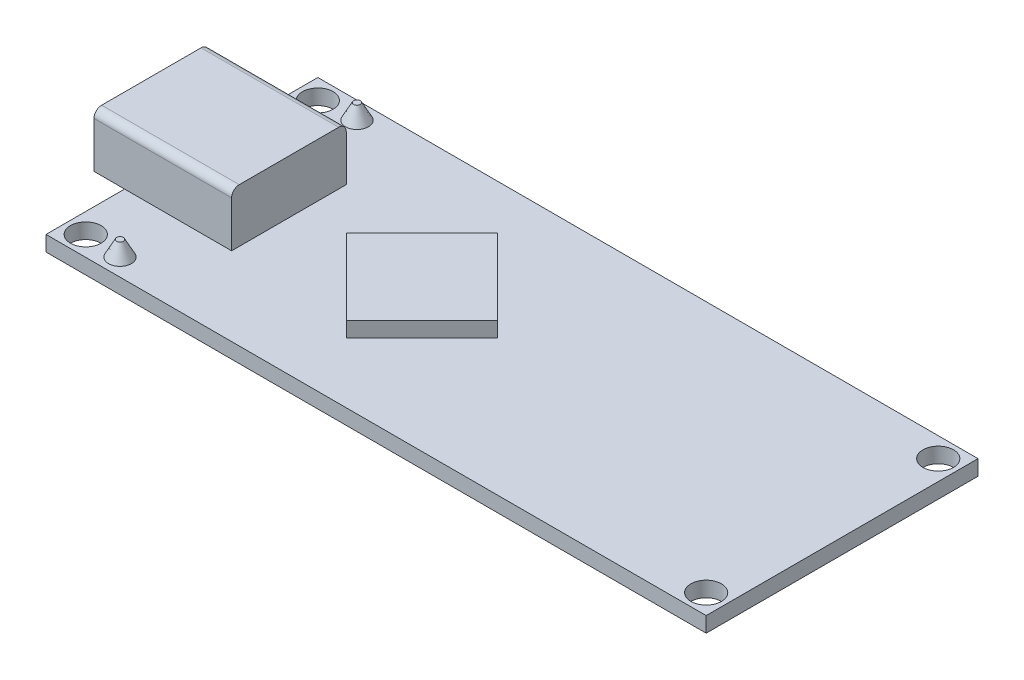
ISO-10303-21;
HEADER;
FILE_DESCRIPTION(('STEP AP214'),'2;1');
FILE_NAME('part.step','',(''),(''),'','','');
FILE_SCHEMA(('AUTOMOTIVE_DESIGN { 1 0 10303 214 1 1 1 1 }'));
ENDSEC;
DATA;
#1=APPLICATION_CONTEXT('core data for automotive mechanical design processes');
#2=APPLICATION_PROTOCOL_DEFINITION('international standard','automotive_design',2000,#1);
#3=PRODUCT_CONTEXT('',#1,'mechanical');
#4=PRODUCT('Part','Part','',(#3));
#5=PRODUCT_RELATED_PRODUCT_CATEGORY('part','',(#4));
#6=PRODUCT_DEFINITION_FORMATION('','',#4);
#7=PRODUCT_DEFINITION_CONTEXT('part definition',#1,'design');
#8=PRODUCT_DEFINITION('design','',#6,#7);
#9=PRODUCT_DEFINITION_SHAPE('','',#8);
#10=(LENGTH_UNIT() NAMED_UNIT(*) SI_UNIT(.MILLI.,.METRE.));
#11=(NAMED_UNIT(*) PLANE_ANGLE_UNIT() SI_UNIT($,.RADIAN.));
#12=(NAMED_UNIT(*) SI_UNIT($,.STERADIAN.) SOLID_ANGLE_UNIT());
#13=UNCERTAINTY_MEASURE_WITH_UNIT(LENGTH_MEASURE(1.E-05),#10,'distance_accuracy_value','');
#14=(GEOMETRIC_REPRESENTATION_CONTEXT(3) GLOBAL_UNCERTAINTY_ASSIGNED_CONTEXT((#13)) GLOBAL_UNIT_ASSIGNED_CONTEXT((#10,
#11,#12)) REPRESENTATION_CONTEXT('',''));
#15=CARTESIAN_POINT('',(0.,0.,0.));
#16=DIRECTION('',(0.,0.,1.));
#17=DIRECTION('',(1.,0.,0.));
#18=AXIS2_PLACEMENT_3D('',#15,#16,#17);
#19=CARTESIAN_POINT('',(0.,1.,0.));
#20=DIRECTION('',(0.,-1.,0.));
#21=DIRECTION('',(0.,0.,-1.));
#22=AXIS2_PLACEMENT_3D('',#19,#20,#21);
#23=PLANE('',#22);
#24=CARTESIAN_POINT('',(20.29,1.,-7.59));
#25=DIRECTION('',(0.,1.,0.));
#26=DIRECTION('',(0.,0.,1.));
#27=AXIS2_PLACEMENT_3D('',#24,#25,#26);
#28=CIRCLE('',#27,1.);
#29=CARTESIAN_POINT('',(20.29,1.,-6.59));
#30=VERTEX_POINT('',#29);
#31=EDGE_CURVE('E259',#30,#30,#28,.T.);
#32=ORIENTED_EDGE('',*,*,#31,.F.);
#33=EDGE_LOOP('',(#32));
#34=FACE_BOUND('',#33,.T.);
#35=CARTESIAN_POINT('',(20.29,1.,7.59));
#36=DIRECTION('',(0.,1.,0.));
#37=DIRECTION('',(0.,0.,1.));
#38=AXIS2_PLACEMENT_3D('',#35,#36,#37);
#39=CIRCLE('',#38,1.);
#40=CARTESIAN_POINT('',(20.29,1.,8.59));
#41=VERTEX_POINT('',#40);
#42=EDGE_CURVE('E269',#41,#41,#39,.T.);
#43=ORIENTED_EDGE('',*,*,#42,.F.);
#44=EDGE_LOOP('',(#43));
#45=FACE_BOUND('',#44,.T.);
#46=CARTESIAN_POINT('',(-20.29,1.,7.59));
#47=DIRECTION('',(0.,1.,0.));
#48=DIRECTION('',(0.,0.,1.));
#49=AXIS2_PLACEMENT_3D('',#46,#47,#48);
#50=CIRCLE('',#49,1.);
#51=CARTESIAN_POINT('',(-20.29,1.,8.59));
#52=VERTEX_POINT('',#51);
#53=EDGE_CURVE('E275',#52,#52,#50,.T.);
#54=ORIENTED_EDGE('',*,*,#53,.F.);
#55=EDGE_LOOP('',(#54));
#56=FACE_BOUND('',#55,.T.);
#57=CARTESIAN_POINT('',(-20.29,1.,-7.59));
#58=DIRECTION('',(0.,1.,0.));
#59=DIRECTION('',(0.,0.,1.));
#60=AXIS2_PLACEMENT_3D('',#57,#58,#59);
#61=CIRCLE('',#60,1.);
#62=CARTESIAN_POINT('',(-20.29,1.,-6.59));
#63=VERTEX_POINT('',#62);
#64=EDGE_CURVE('E281',#63,#63,#61,.T.);
#65=ORIENTED_EDGE('',*,*,#64,.F.);
#66=EDGE_LOOP('',(#65));
#67=FACE_BOUND('',#66,.T.);
#68=DIRECTION('',(0.707106781186547,0.,0.707106781186547));
#69=VECTOR('',#68,1.);
#70=CARTESIAN_POINT('',(-5.89000000000001,1.,4.94974746830583));
#71=LINE('',#70,#69);
#72=CARTESIAN_POINT('',(-10.8397474683058,1.,0.));
#73=VERTEX_POINT('',#72);
#74=CARTESIAN_POINT('',(-5.89000000000001,1.,4.94974746830583));
#75=VERTEX_POINT('',#74);
#76=EDGE_CURVE('E317',#73,#75,#71,.T.);
#77=ORIENTED_EDGE('',*,*,#76,.F.);
#78=DIRECTION('',(-0.707106781186547,0.,0.707106781186547));
#79=VECTOR('',#78,1.);
#80=CARTESIAN_POINT('',(-10.8397474683058,1.,0.));
#81=LINE('',#80,#79);
#82=CARTESIAN_POINT('',(-5.89000000000001,1.,-4.94974746830583));
#83=VERTEX_POINT('',#82);
#84=EDGE_CURVE('E322',#83,#73,#81,.T.);
#85=ORIENTED_EDGE('',*,*,#84,.F.);
#86=DIRECTION('',(-0.707106781186547,0.,-0.707106781186547));
#87=VECTOR('',#86,1.);
#88=CARTESIAN_POINT('',(-5.89000000000001,1.,-4.94974746830583));
#89=LINE('',#88,#87);
#90=CARTESIAN_POINT('',(-0.940252531694178,1.,0.));
#91=VERTEX_POINT('',#90);
#92=EDGE_CURVE('E334',#91,#83,#89,.T.);
#93=ORIENTED_EDGE('',*,*,#92,.F.);
#94=DIRECTION('',(0.707106781186547,0.,-0.707106781186547));
#95=VECTOR('',#94,1.);
#96=CARTESIAN_POINT('',(-0.940252531694177,1.,0.));
#97=LINE('',#96,#95);
#98=EDGE_CURVE('E331',#75,#91,#97,.T.);
#99=ORIENTED_EDGE('',*,*,#98,.F.);
#100=EDGE_LOOP('',(#77,#85,#93,#99));
#101=FACE_BOUND('',#100,.T.);
#102=CARTESIAN_POINT('',(-17.89,1.,-7.75));
#103=DIRECTION('',(0.,-1.,0.));
#104=DIRECTION('',(0.,0.,-1.));
#105=AXIS2_PLACEMENT_3D('',#102,#103,#104);
#106=CIRCLE('',#105,0.750000000000002);
#107=CARTESIAN_POINT('',(-17.89,1.,-8.5));
#108=VERTEX_POINT('',#107);
#109=EDGE_CURVE('E389',#108,#108,#106,.F.);
#110=ORIENTED_EDGE('',*,*,#109,.F.);
#111=EDGE_LOOP('',(#110));
#112=FACE_BOUND('',#111,.T.);
#113=CARTESIAN_POINT('',(-17.89,1.,7.75));
#114=DIRECTION('',(0.,-1.,0.));
#115=DIRECTION('',(0.,0.,-1.));
#116=AXIS2_PLACEMENT_3D('',#113,#114,#115);
#117=CIRCLE('',#116,0.750000000000002);
#118=CARTESIAN_POINT('',(-17.89,1.,7.));
#119=VERTEX_POINT('',#118);
#120=EDGE_CURVE('E392',#119,#119,#117,.F.);
#121=ORIENTED_EDGE('',*,*,#120,.F.);
#122=EDGE_LOOP('',(#121));
#123=FACE_BOUND('',#122,.T.);
#124=DIRECTION('',(-1.,0.,0.));
#125=VECTOR('',#124,1.);
#126=CARTESIAN_POINT('',(-14.59,1.,-3.75));
#127=LINE('',#126,#125);
#128=CARTESIAN_POINT('',(-14.59,1.,-3.75));
#129=VERTEX_POINT('',#128);
#130=CARTESIAN_POINT('',(-21.59,1.,-3.75));
#131=VERTEX_POINT('',#130);
#132=EDGE_CURVE('E301',#129,#131,#127,.T.);
#133=ORIENTED_EDGE('',*,*,#132,.F.);
#134=DIRECTION('',(0.,0.,-1.));
#135=VECTOR('',#134,1.);
#136=CARTESIAN_POINT('',(-14.59,1.,-3.75));
#137=LINE('',#136,#135);
#138=CARTESIAN_POINT('',(-14.59,1.,3.75));
#139=VERTEX_POINT('',#138);
#140=EDGE_CURVE('E287',#139,#129,#137,.T.);
#141=ORIENTED_EDGE('',*,*,#140,.F.);
#142=DIRECTION('',(1.,0.,0.));
#143=VECTOR('',#142,1.);
#144=CARTESIAN_POINT('',(-14.59,1.,3.75));
#145=LINE('',#144,#143);
#146=CARTESIAN_POINT('',(-21.59,1.,3.75));
#147=VERTEX_POINT('',#146);
#148=EDGE_CURVE('E307',#147,#139,#145,.T.);
#149=ORIENTED_EDGE('',*,*,#148,.F.);
#150=DIRECTION('',(0.,0.,1.));
#151=VECTOR('',#150,1.);
#152=CARTESIAN_POINT('',(-21.59,1.,8.89));
#153=LINE('',#152,#151);
#154=CARTESIAN_POINT('',(-21.59,1.,8.89));
#155=VERTEX_POINT('',#154);
#156=EDGE_CURVE('E363',#147,#155,#153,.T.);
#157=ORIENTED_EDGE('',*,*,#156,.T.);
#158=DIRECTION('',(1.,0.,0.));
#159=VECTOR('',#158,1.);
#160=CARTESIAN_POINT('',(-21.59,1.,8.89));
#161=LINE('',#160,#159);
#162=CARTESIAN_POINT('',(21.59,1.,8.89));
#163=VERTEX_POINT('',#162);
#164=EDGE_CURVE('E367',#155,#163,#161,.T.);
#165=ORIENTED_EDGE('',*,*,#164,.T.);
#166=DIRECTION('',(0.,0.,-1.));
#167=VECTOR('',#166,1.);
#168=CARTESIAN_POINT('',(21.59,1.,8.89));
#169=LINE('',#168,#167);
#170=CARTESIAN_POINT('',(21.59,1.,-8.89));
#171=VERTEX_POINT('',#170);
#172=EDGE_CURVE('E357',#163,#171,#169,.T.);
#173=ORIENTED_EDGE('',*,*,#172,.T.);
#174=DIRECTION('',(-1.,0.,0.));
#175=VECTOR('',#174,1.);
#176=CARTESIAN_POINT('',(-21.59,1.,-8.89));
#177=LINE('',#176,#175);
#178=CARTESIAN_POINT('',(-21.59,1.,-8.89));
#179=VERTEX_POINT('',#178);
#180=EDGE_CURVE('E360',#171,#179,#177,.T.);
#181=ORIENTED_EDGE('',*,*,#180,.T.);
#182=EDGE_CURVE('E364',#179,#131,#153,.T.);
#183=ORIENTED_EDGE('',*,*,#182,.T.);
#184=EDGE_LOOP('',(#133,#141,#149,#157,#165,#173,#181,#183));
#185=FACE_BOUND('',#184,.T.);
#186=ADVANCED_FACE('F34',(#34,#45,#56,#67,#101,#112,#123,#185),#23,.F.);
#187=CARTESIAN_POINT('',(21.59,1.,8.89));
#188=DIRECTION('',(-1.,0.,0.));
#189=DIRECTION('',(0.,0.,1.));
#190=AXIS2_PLACEMENT_3D('',#187,#188,#189);
#191=PLANE('',#190);
#192=DIRECTION('',(0.,0.,-1.));
#193=VECTOR('',#192,1.);
#194=CARTESIAN_POINT('',(21.59,0.,8.89));
#195=LINE('',#194,#193);
#196=CARTESIAN_POINT('',(21.59,0.,8.89));
#197=VERTEX_POINT('',#196);
#198=CARTESIAN_POINT('',(21.59,0.,-8.89));
#199=VERTEX_POINT('',#198);
#200=EDGE_CURVE('E356',#197,#199,#195,.T.);
#201=ORIENTED_EDGE('',*,*,#200,.T.);
#202=DIRECTION('',(0.,-1.,0.));
#203=VECTOR('',#202,1.);
#204=CARTESIAN_POINT('',(21.59,1.,-8.89));
#205=LINE('',#204,#203);
#206=EDGE_CURVE('E386',#171,#199,#205,.T.);
#207=ORIENTED_EDGE('',*,*,#206,.F.);
#208=ORIENTED_EDGE('',*,*,#172,.F.);
#209=DIRECTION('',(0.,-1.,0.));
#210=VECTOR('',#209,1.);
#211=CARTESIAN_POINT('',(21.59,1.,8.89));
#212=LINE('',#211,#210);
#213=EDGE_CURVE('E370',#163,#197,#212,.T.);
#214=ORIENTED_EDGE('',*,*,#213,.T.);
#215=EDGE_LOOP('',(#201,#207,#208,#214));
#216=FACE_BOUND('',#215,.T.);
#217=ADVANCED_FACE('F451',(#216),#191,.F.);
#218=CARTESIAN_POINT('',(-21.59,1.,-8.89));
#219=DIRECTION('',(0.,0.,1.));
#220=DIRECTION('',(1.,0.,0.));
#221=AXIS2_PLACEMENT_3D('',#218,#219,#220);
#222=PLANE('',#221);
#223=DIRECTION('',(-1.,0.,0.));
#224=VECTOR('',#223,1.);
#225=CARTESIAN_POINT('',(-21.59,0.,-8.89));
#226=LINE('',#225,#224);
#227=CARTESIAN_POINT('',(-21.59,0.,-8.89));
#228=VERTEX_POINT('',#227);
#229=EDGE_CURVE('E373',#199,#228,#226,.T.);
#230=ORIENTED_EDGE('',*,*,#229,.T.);
#231=DIRECTION('',(0.,-1.,0.));
#232=VECTOR('',#231,1.);
#233=CARTESIAN_POINT('',(-21.59,1.,-8.89));
#234=LINE('',#233,#232);
#235=EDGE_CURVE('E383',#179,#228,#234,.T.);
#236=ORIENTED_EDGE('',*,*,#235,.F.);
#237=ORIENTED_EDGE('',*,*,#180,.F.);
#238=ORIENTED_EDGE('',*,*,#206,.T.);
#239=EDGE_LOOP('',(#230,#236,#237,#238));
#240=FACE_BOUND('',#239,.T.);
#241=ADVANCED_FACE('F453',(#240),#222,.F.);
#242=CARTESIAN_POINT('',(-21.59,1.,8.89));
#243=DIRECTION('',(1.,0.,0.));
#244=DIRECTION('',(0.,0.,-1.));
#245=AXIS2_PLACEMENT_3D('',#242,#243,#244);
#246=PLANE('',#245);
#247=DIRECTION('',(0.,0.,1.));
#248=VECTOR('',#247,1.);
#249=CARTESIAN_POINT('',(-21.59,0.,8.89));
#250=LINE('',#249,#248);
#251=CARTESIAN_POINT('',(-21.59,0.,8.89));
#252=VERTEX_POINT('',#251);
#253=EDGE_CURVE('E375',#228,#252,#250,.T.);
#254=ORIENTED_EDGE('',*,*,#253,.T.);
#255=DIRECTION('',(0.,-1.,0.));
#256=VECTOR('',#255,1.);
#257=CARTESIAN_POINT('',(-21.59,1.,8.89));
#258=LINE('',#257,#256);
#259=EDGE_CURVE('E380',#155,#252,#258,.T.);
#260=ORIENTED_EDGE('',*,*,#259,.F.);
#261=ORIENTED_EDGE('',*,*,#156,.F.);
#262=EDGE_CURVE('E368',#131,#147,#153,.T.);
#263=ORIENTED_EDGE('',*,*,#262,.F.);
#264=ORIENTED_EDGE('',*,*,#182,.F.);
#265=ORIENTED_EDGE('',*,*,#235,.T.);
#266=EDGE_LOOP('',(#254,#260,#261,#263,#264,#265));
#267=FACE_BOUND('',#266,.T.);
#268=ADVANCED_FACE('F439',(#267),#246,.F.);
#269=CARTESIAN_POINT('',(-21.59,1.,8.89));
#270=DIRECTION('',(0.,0.,-1.));
#271=DIRECTION('',(-1.,0.,0.));
#272=AXIS2_PLACEMENT_3D('',#269,#270,#271);
#273=PLANE('',#272);
#274=DIRECTION('',(1.,0.,0.));
#275=VECTOR('',#274,1.);
#276=CARTESIAN_POINT('',(-21.59,0.,8.89));
#277=LINE('',#276,#275);
#278=EDGE_CURVE('E361',#252,#197,#277,.T.);
#279=ORIENTED_EDGE('',*,*,#278,.T.);
#280=ORIENTED_EDGE('',*,*,#213,.F.);
#281=ORIENTED_EDGE('',*,*,#164,.F.);
#282=ORIENTED_EDGE('',*,*,#259,.T.);
#283=EDGE_LOOP('',(#279,#280,#281,#282));
#284=FACE_BOUND('',#283,.T.);
#285=ADVANCED_FACE('F446',(#284),#273,.F.);
#286=CARTESIAN_POINT('',(0.,0.,0.));
#287=DIRECTION('',(0.,-1.,0.));
#288=DIRECTION('',(0.,0.,-1.));
#289=AXIS2_PLACEMENT_3D('',#286,#287,#288);
#290=PLANE('',#289);
#291=CARTESIAN_POINT('',(20.29,0.,-7.59));
#292=DIRECTION('',(0.,1.,0.));
#293=DIRECTION('',(0.,0.,1.));
#294=AXIS2_PLACEMENT_3D('',#291,#292,#293);
#295=CIRCLE('',#294,1.);
#296=CARTESIAN_POINT('',(20.29,0.,-6.59));
#297=VERTEX_POINT('',#296);
#298=EDGE_CURVE('E266',#297,#297,#295,.T.);
#299=ORIENTED_EDGE('',*,*,#298,.T.);
#300=EDGE_LOOP('',(#299));
#301=FACE_BOUND('',#300,.T.);
#302=CARTESIAN_POINT('',(20.29,0.,7.59));
#303=DIRECTION('',(0.,1.,0.));
#304=DIRECTION('',(0.,0.,1.));
#305=AXIS2_PLACEMENT_3D('',#302,#303,#304);
#306=CIRCLE('',#305,1.);
#307=CARTESIAN_POINT('',(20.29,0.,8.59));
#308=VERTEX_POINT('',#307);
#309=EDGE_CURVE('E272',#308,#308,#306,.T.);
#310=ORIENTED_EDGE('',*,*,#309,.T.);
#311=EDGE_LOOP('',(#310));
#312=FACE_BOUND('',#311,.T.);
#313=CARTESIAN_POINT('',(-20.29,0.,7.59));
#314=DIRECTION('',(0.,1.,0.));
#315=DIRECTION('',(0.,0.,1.));
#316=AXIS2_PLACEMENT_3D('',#313,#314,#315);
#317=CIRCLE('',#316,1.);
#318=CARTESIAN_POINT('',(-20.29,0.,8.59));
#319=VERTEX_POINT('',#318);
#320=EDGE_CURVE('E278',#319,#319,#317,.T.);
#321=ORIENTED_EDGE('',*,*,#320,.T.);
#322=EDGE_LOOP('',(#321));
#323=FACE_BOUND('',#322,.T.);
#324=CARTESIAN_POINT('',(-20.29,0.,-7.59));
#325=DIRECTION('',(0.,1.,0.));
#326=DIRECTION('',(0.,0.,1.));
#327=AXIS2_PLACEMENT_3D('',#324,#325,#326);
#328=CIRCLE('',#327,1.);
#329=CARTESIAN_POINT('',(-20.29,0.,-6.59));
#330=VERTEX_POINT('',#329);
#331=EDGE_CURVE('E284',#330,#330,#328,.T.);
#332=ORIENTED_EDGE('',*,*,#331,.T.);
#333=EDGE_LOOP('',(#332));
#334=FACE_BOUND('',#333,.T.);
#335=ORIENTED_EDGE('',*,*,#200,.F.);
#336=ORIENTED_EDGE('',*,*,#278,.F.);
#337=ORIENTED_EDGE('',*,*,#253,.F.);
#338=ORIENTED_EDGE('',*,*,#229,.F.);
#339=EDGE_LOOP('',(#335,#336,#337,#338));
#340=FACE_BOUND('',#339,.T.);
#341=ADVANCED_FACE('F455',(#301,#312,#323,#334,#340),#290,.T.);
#342=CARTESIAN_POINT('',(-17.89,1.,-7.75));
#343=DIRECTION('',(0.,-1.,0.));
#344=DIRECTION('',(0.,0.,1.));
#345=AXIS2_PLACEMENT_3D('',#342,#343,#344);
#346=CONICAL_SURFACE('',#345,0.750000000000002,0.488692190558413);
#347=CARTESIAN_POINT('',(-17.89,2.,-7.75));
#348=DIRECTION('',(0.,1.,0.));
#349=DIRECTION('',(0.,0.,1.));
#350=AXIS2_PLACEMENT_3D('',#347,#348,#349);
#351=CIRCLE('',#350,0.218290568338523);
#352=CARTESIAN_POINT('',(-17.89,2.,-7.53170943166148));
#353=VERTEX_POINT('',#352);
#354=EDGE_CURVE('E353',#353,#353,#351,.T.);
#355=ORIENTED_EDGE('',*,*,#354,.F.);
#356=EDGE_LOOP('',(#355));
#357=FACE_BOUND('',#356,.T.);
#358=ORIENTED_EDGE('',*,*,#109,.T.);
#359=EDGE_LOOP('',(#358));
#360=FACE_BOUND('',#359,.T.);
#361=ADVANCED_FACE('F457',(#357,#360),#346,.T.);
#362=CARTESIAN_POINT('',(-17.89,2.,-7.75));
#363=DIRECTION('',(0.,1.,0.));
#364=DIRECTION('',(0.,0.,1.));
#365=AXIS2_PLACEMENT_3D('',#362,#363,#364);
#366=PLANE('',#365);
#367=ORIENTED_EDGE('',*,*,#354,.T.);
#368=EDGE_LOOP('',(#367));
#369=FACE_BOUND('',#368,.T.);
#370=ADVANCED_FACE('F464',(#369),#366,.T.);
#371=CARTESIAN_POINT('',(-17.89,1.,7.75));
#372=DIRECTION('',(0.,-1.,0.));
#373=DIRECTION('',(0.,0.,1.));
#374=AXIS2_PLACEMENT_3D('',#371,#372,#373);
#375=CONICAL_SURFACE('',#374,0.750000000000002,0.488692190558413);
#376=CARTESIAN_POINT('',(-17.89,2.,7.75));
#377=DIRECTION('',(0.,1.,0.));
#378=DIRECTION('',(0.,0.,1.));
#379=AXIS2_PLACEMENT_3D('',#376,#377,#378);
#380=CIRCLE('',#379,0.218290568338523);
#381=CARTESIAN_POINT('',(-17.89,2.,7.96829056833853));
#382=VERTEX_POINT('',#381);
#383=EDGE_CURVE('E350',#382,#382,#380,.T.);
#384=ORIENTED_EDGE('',*,*,#383,.F.);
#385=EDGE_LOOP('',(#384));
#386=FACE_BOUND('',#385,.T.);
#387=ORIENTED_EDGE('',*,*,#120,.T.);
#388=EDGE_LOOP('',(#387));
#389=FACE_BOUND('',#388,.T.);
#390=ADVANCED_FACE('F481',(#386,#389),#375,.T.);
#391=CARTESIAN_POINT('',(-17.89,2.,7.75));
#392=DIRECTION('',(0.,1.,0.));
#393=DIRECTION('',(0.,0.,1.));
#394=AXIS2_PLACEMENT_3D('',#391,#392,#393);
#395=PLANE('',#394);
#396=ORIENTED_EDGE('',*,*,#383,.T.);
#397=EDGE_LOOP('',(#396));
#398=FACE_BOUND('',#397,.T.);
#399=ADVANCED_FACE('F485',(#398),#395,.T.);
#400=CARTESIAN_POINT('',(-5.89000000000001,2.,4.94974746830583));
#401=DIRECTION('',(0.707106781186547,0.,-0.707106781186547));
#402=DIRECTION('',(-0.707106781186548,0.,-0.707106781186548));
#403=AXIS2_PLACEMENT_3D('',#400,#401,#402);
#404=PLANE('',#403);
#405=ORIENTED_EDGE('',*,*,#76,.T.);
#406=DIRECTION('',(0.,-1.,0.));
#407=VECTOR('',#406,1.);
#408=CARTESIAN_POINT('',(-5.89000000000001,2.,4.94974746830583));
#409=LINE('',#408,#407);
#410=CARTESIAN_POINT('',(-5.89000000000001,2.,4.94974746830583));
#411=VERTEX_POINT('',#410);
#412=EDGE_CURVE('E347',#411,#75,#409,.T.);
#413=ORIENTED_EDGE('',*,*,#412,.F.);
#414=DIRECTION('',(0.707106781186547,0.,0.707106781186547));
#415=VECTOR('',#414,1.);
#416=CARTESIAN_POINT('',(-5.89000000000001,2.,4.94974746830583));
#417=LINE('',#416,#415);
#418=CARTESIAN_POINT('',(-10.8397474683058,2.,0.));
#419=VERTEX_POINT('',#418);
#420=EDGE_CURVE('E318',#419,#411,#417,.T.);
#421=ORIENTED_EDGE('',*,*,#420,.F.);
#422=DIRECTION('',(0.,-1.,0.));
#423=VECTOR('',#422,1.);
#424=CARTESIAN_POINT('',(-10.8397474683058,2.,0.));
#425=LINE('',#424,#423);
#426=EDGE_CURVE('E328',#419,#73,#425,.T.);
#427=ORIENTED_EDGE('',*,*,#426,.T.);
#428=EDGE_LOOP('',(#405,#413,#421,#427));
#429=FACE_BOUND('',#428,.T.);
#430=ADVANCED_FACE('F489',(#429),#404,.F.);
#431=CARTESIAN_POINT('',(-0.940252531694177,2.,0.));
#432=DIRECTION('',(-0.707106781186547,0.,-0.707106781186547));
#433=DIRECTION('',(-0.707106781186548,0.,0.707106781186548));
#434=AXIS2_PLACEMENT_3D('',#431,#432,#433);
#435=PLANE('',#434);
#436=ORIENTED_EDGE('',*,*,#98,.T.);
#437=DIRECTION('',(0.,-1.,0.));
#438=VECTOR('',#437,1.);
#439=CARTESIAN_POINT('',(-0.940252531694177,2.,0.));
#440=LINE('',#439,#438);
#441=CARTESIAN_POINT('',(-0.940252531694177,2.,0.));
#442=VERTEX_POINT('',#441);
#443=EDGE_CURVE('E344',#442,#91,#440,.T.);
#444=ORIENTED_EDGE('',*,*,#443,.F.);
#445=DIRECTION('',(0.707106781186547,0.,-0.707106781186547));
#446=VECTOR('',#445,1.);
#447=CARTESIAN_POINT('',(-0.940252531694177,2.,0.));
#448=LINE('',#447,#446);
#449=EDGE_CURVE('E321',#411,#442,#448,.T.);
#450=ORIENTED_EDGE('',*,*,#449,.F.);
#451=ORIENTED_EDGE('',*,*,#412,.T.);
#452=EDGE_LOOP('',(#436,#444,#450,#451));
#453=FACE_BOUND('',#452,.T.);
#454=ADVANCED_FACE('F493',(#453),#435,.F.);
#455=CARTESIAN_POINT('',(-5.89000000000001,2.,-4.94974746830583));
#456=DIRECTION('',(-0.707106781186547,0.,0.707106781186547));
#457=DIRECTION('',(0.707106781186548,0.,0.707106781186548));
#458=AXIS2_PLACEMENT_3D('',#455,#456,#457);
#459=PLANE('',#458);
#460=ORIENTED_EDGE('',*,*,#92,.T.);
#461=DIRECTION('',(0.,-1.,0.));
#462=VECTOR('',#461,1.);
#463=CARTESIAN_POINT('',(-5.89000000000001,2.,-4.94974746830583));
#464=LINE('',#463,#462);
#465=CARTESIAN_POINT('',(-5.89000000000001,2.,-4.94974746830583));
#466=VERTEX_POINT('',#465);
#467=EDGE_CURVE('E341',#466,#83,#464,.T.);
#468=ORIENTED_EDGE('',*,*,#467,.F.);
#469=DIRECTION('',(-0.707106781186547,0.,-0.707106781186547));
#470=VECTOR('',#469,1.);
#471=CARTESIAN_POINT('',(-5.89000000000001,2.,-4.94974746830583));
#472=LINE('',#471,#470);
#473=EDGE_CURVE('E324',#442,#466,#472,.T.);
#474=ORIENTED_EDGE('',*,*,#473,.F.);
#475=ORIENTED_EDGE('',*,*,#443,.T.);
#476=EDGE_LOOP('',(#460,#468,#474,#475));
#477=FACE_BOUND('',#476,.T.);
#478=ADVANCED_FACE('F497',(#477),#459,.F.);
#479=CARTESIAN_POINT('',(-10.8397474683058,2.,0.));
#480=DIRECTION('',(0.707106781186547,0.,0.707106781186547));
#481=DIRECTION('',(0.707106781186548,0.,-0.707106781186548));
#482=AXIS2_PLACEMENT_3D('',#479,#480,#481);
#483=PLANE('',#482);
#484=ORIENTED_EDGE('',*,*,#84,.T.);
#485=ORIENTED_EDGE('',*,*,#426,.F.);
#486=DIRECTION('',(-0.707106781186547,0.,0.707106781186547));
#487=VECTOR('',#486,1.);
#488=CARTESIAN_POINT('',(-10.8397474683058,2.,0.));
#489=LINE('',#488,#487);
#490=EDGE_CURVE('E326',#466,#419,#489,.T.);
#491=ORIENTED_EDGE('',*,*,#490,.F.);
#492=ORIENTED_EDGE('',*,*,#467,.T.);
#493=EDGE_LOOP('',(#484,#485,#491,#492));
#494=FACE_BOUND('',#493,.T.);
#495=ADVANCED_FACE('F501',(#494),#483,.F.);
#496=CARTESIAN_POINT('',(0.,2.,0.));
#497=DIRECTION('',(0.,-1.,0.));
#498=DIRECTION('',(0.,0.,-1.));
#499=AXIS2_PLACEMENT_3D('',#496,#497,#498);
#500=PLANE('',#499);
#501=ORIENTED_EDGE('',*,*,#420,.T.);
#502=ORIENTED_EDGE('',*,*,#449,.T.);
#503=ORIENTED_EDGE('',*,*,#473,.T.);
#504=ORIENTED_EDGE('',*,*,#490,.T.);
#505=EDGE_LOOP('',(#501,#502,#503,#504));
#506=FACE_BOUND('',#505,.T.);
#507=ADVANCED_FACE('F505',(#506),#500,.F.);
#508=CARTESIAN_POINT('',(0.,1.,0.));
#509=DIRECTION('',(0.,-1.,0.));
#510=DIRECTION('',(0.,0.,-1.));
#511=AXIS2_PLACEMENT_3D('',#508,#509,#510);
#512=PLANE('',#511);
#513=ORIENTED_EDGE('',*,*,#262,.T.);
#514=CARTESIAN_POINT('',(-23.59,1.,3.75));
#515=VERTEX_POINT('',#514);
#516=EDGE_CURVE('E294',#515,#147,#145,.T.);
#517=ORIENTED_EDGE('',*,*,#516,.F.);
#518=DIRECTION('',(0.,0.,1.));
#519=VECTOR('',#518,1.);
#520=CARTESIAN_POINT('',(-23.59,1.,-3.75));
#521=LINE('',#520,#519);
#522=CARTESIAN_POINT('',(-23.59,1.,-3.75));
#523=VERTEX_POINT('',#522);
#524=EDGE_CURVE('E304',#523,#515,#521,.T.);
#525=ORIENTED_EDGE('',*,*,#524,.F.);
#526=EDGE_CURVE('E300',#131,#523,#127,.T.);
#527=ORIENTED_EDGE('',*,*,#526,.F.);
#528=EDGE_LOOP('',(#513,#517,#525,#527));
#529=FACE_BOUND('',#528,.T.);
#530=ADVANCED_FACE('F425',(#529),#512,.T.);
#531=CARTESIAN_POINT('',(-14.59,4.5,-3.75));
#532=DIRECTION('',(-1.,0.,0.));
#533=DIRECTION('',(0.,0.,1.));
#534=AXIS2_PLACEMENT_3D('',#531,#532,#533);
#535=PLANE('',#534);
#536=DIRECTION('',(0.,-1.,0.));
#537=VECTOR('',#536,1.);
#538=CARTESIAN_POINT('',(-14.59,4.5,-3.75));
#539=LINE('',#538,#537);
#540=CARTESIAN_POINT('',(-14.59,4.,-3.75));
#541=VERTEX_POINT('',#540);
#542=EDGE_CURVE('E315',#541,#129,#539,.T.);
#543=ORIENTED_EDGE('',*,*,#542,.F.);
#544=CARTESIAN_POINT('',(-14.59,4.,-3.25));
#545=DIRECTION('',(-1.,0.,0.));
#546=DIRECTION('',(0.,0.,1.));
#547=AXIS2_PLACEMENT_3D('',#544,#545,#546);
#548=CIRCLE('',#547,0.5);
#549=CARTESIAN_POINT('',(-14.59,4.5,-3.25));
#550=VERTEX_POINT('',#549);
#551=EDGE_CURVE('E42',#541,#550,#548,.F.);
#552=ORIENTED_EDGE('',*,*,#551,.T.);
#553=DIRECTION('',(0.,0.,-1.));
#554=VECTOR('',#553,1.);
#555=CARTESIAN_POINT('',(-14.59,4.5,-3.75));
#556=LINE('',#555,#554);
#557=CARTESIAN_POINT('',(-14.59,4.5,3.25));
#558=VERTEX_POINT('',#557);
#559=EDGE_CURVE('E290',#558,#550,#556,.T.);
#560=ORIENTED_EDGE('',*,*,#559,.F.);
#561=CARTESIAN_POINT('',(-14.59,4.,3.25));
#562=DIRECTION('',(-1.,0.,0.));
#563=DIRECTION('',(0.,0.,1.));
#564=AXIS2_PLACEMENT_3D('',#561,#562,#563);
#565=CIRCLE('',#564,0.5);
#566=CARTESIAN_POINT('',(-14.59,4.,3.75));
#567=VERTEX_POINT('',#566);
#568=EDGE_CURVE('E49',#558,#567,#565,.F.);
#569=ORIENTED_EDGE('',*,*,#568,.T.);
#570=DIRECTION('',(0.,-1.,0.));
#571=VECTOR('',#570,1.);
#572=CARTESIAN_POINT('',(-14.59,4.5,3.75));
#573=LINE('',#572,#571);
#574=EDGE_CURVE('E297',#567,#139,#573,.T.);
#575=ORIENTED_EDGE('',*,*,#574,.T.);
#576=ORIENTED_EDGE('',*,*,#140,.T.);
#577=EDGE_LOOP('',(#543,#552,#560,#569,#575,#576));
#578=FACE_BOUND('',#577,.T.);
#579=ADVANCED_FACE('F407',(#578),#535,.F.);
#580=CARTESIAN_POINT('',(-14.59,4.5,-3.75));
#581=DIRECTION('',(0.,0.,1.));
#582=DIRECTION('',(1.,0.,0.));
#583=AXIS2_PLACEMENT_3D('',#580,#581,#582);
#584=PLANE('',#583);
#585=DIRECTION('',(0.,-1.,0.));
#586=VECTOR('',#585,1.);
#587=CARTESIAN_POINT('',(-23.59,4.5,-3.75));
#588=LINE('',#587,#586);
#589=CARTESIAN_POINT('',(-23.59,4.,-3.75));
#590=VERTEX_POINT('',#589);
#591=EDGE_CURVE('E313',#590,#523,#588,.T.);
#592=ORIENTED_EDGE('',*,*,#591,.F.);
#593=DIRECTION('',(-1.,0.,0.));
#594=VECTOR('',#593,1.);
#595=CARTESIAN_POINT('',(-14.59,4.,-3.75));
#596=LINE('',#595,#594);
#597=EDGE_CURVE('E57',#590,#541,#596,.F.);
#598=ORIENTED_EDGE('',*,*,#597,.T.);
#599=ORIENTED_EDGE('',*,*,#542,.T.);
#600=ORIENTED_EDGE('',*,*,#132,.T.);
#601=ORIENTED_EDGE('',*,*,#526,.T.);
#602=EDGE_LOOP('',(#592,#598,#599,#600,#601));
#603=FACE_BOUND('',#602,.T.);
#604=ADVANCED_FACE('F418',(#603),#584,.F.);
#605=CARTESIAN_POINT('',(-23.59,4.5,-3.75));
#606=DIRECTION('',(1.,0.,0.));
#607=DIRECTION('',(0.,0.,-1.));
#608=AXIS2_PLACEMENT_3D('',#605,#606,#607);
#609=PLANE('',#608);
#610=DIRECTION('',(0.,0.,-1.));
#611=VECTOR('',#610,1.);
#612=CARTESIAN_POINT('',(-23.59,4.,-3.25));
#613=LINE('',#612,#611);
#614=CARTESIAN_POINT('',(-23.59,4.,3.25));
#615=VERTEX_POINT('',#614);
#616=CARTESIAN_POINT('',(-23.59,4.,-3.25));
#617=VERTEX_POINT('',#616);
#618=EDGE_CURVE('E249',#615,#617,#613,.T.);
#619=ORIENTED_EDGE('',*,*,#618,.F.);
#620=DIRECTION('',(0.,1.,0.));
#621=VECTOR('',#620,1.);
#622=CARTESIAN_POINT('',(-23.59,1.5,3.25));
#623=LINE('',#622,#621);
#624=CARTESIAN_POINT('',(-23.59,1.5,3.25));
#625=VERTEX_POINT('',#624);
#626=EDGE_CURVE('E230',#625,#615,#623,.T.);
#627=ORIENTED_EDGE('',*,*,#626,.F.);
#628=DIRECTION('',(0.,0.,1.));
#629=VECTOR('',#628,1.);
#630=CARTESIAN_POINT('',(-23.59,1.5,-3.25));
#631=LINE('',#630,#629);
#632=CARTESIAN_POINT('',(-23.59,1.5,-3.25));
#633=VERTEX_POINT('',#632);
#634=EDGE_CURVE('E238',#633,#625,#631,.T.);
#635=ORIENTED_EDGE('',*,*,#634,.F.);
#636=DIRECTION('',(0.,-1.,0.));
#637=VECTOR('',#636,1.);
#638=CARTESIAN_POINT('',(-23.59,1.5,-3.25));
#639=LINE('',#638,#637);
#640=EDGE_CURVE('E252',#617,#633,#639,.T.);
#641=ORIENTED_EDGE('',*,*,#640,.F.);
#642=EDGE_LOOP('',(#619,#627,#635,#641));
#643=FACE_BOUND('',#642,.T.);
#644=DIRECTION('',(0.,0.,1.));
#645=VECTOR('',#644,1.);
#646=CARTESIAN_POINT('',(-23.59,4.5,-3.75));
#647=LINE('',#646,#645);
#648=CARTESIAN_POINT('',(-23.59,4.5,-3.25));
#649=VERTEX_POINT('',#648);
#650=CARTESIAN_POINT('',(-23.59,4.5,3.25));
#651=VERTEX_POINT('',#650);
#652=EDGE_CURVE('E293',#649,#651,#647,.T.);
#653=ORIENTED_EDGE('',*,*,#652,.F.);
#654=CARTESIAN_POINT('',(-23.59,4.,-3.25));
#655=DIRECTION('',(1.,0.,0.));
#656=DIRECTION('',(0.,0.,-1.));
#657=AXIS2_PLACEMENT_3D('',#654,#655,#656);
#658=CIRCLE('',#657,0.5);
#659=EDGE_CURVE('E403',#649,#590,#658,.F.);
#660=ORIENTED_EDGE('',*,*,#659,.T.);
#661=ORIENTED_EDGE('',*,*,#591,.T.);
#662=ORIENTED_EDGE('',*,*,#524,.T.);
#663=DIRECTION('',(0.,-1.,0.));
#664=VECTOR('',#663,1.);
#665=CARTESIAN_POINT('',(-23.59,4.5,3.75));
#666=LINE('',#665,#664);
#667=CARTESIAN_POINT('',(-23.59,4.,3.75));
#668=VERTEX_POINT('',#667);
#669=EDGE_CURVE('E311',#668,#515,#666,.T.);
#670=ORIENTED_EDGE('',*,*,#669,.F.);
#671=CARTESIAN_POINT('',(-23.59,4.,3.25));
#672=DIRECTION('',(1.,0.,0.));
#673=DIRECTION('',(0.,0.,-1.));
#674=AXIS2_PLACEMENT_3D('',#671,#672,#673);
#675=CIRCLE('',#674,0.5);
#676=EDGE_CURVE('E401',#668,#651,#675,.F.);
#677=ORIENTED_EDGE('',*,*,#676,.T.);
#678=EDGE_LOOP('',(#653,#660,#661,#662,#670,#677));
#679=FACE_BOUND('',#678,.T.);
#680=ADVANCED_FACE('F416',(#643,#679),#609,.F.);
#681=CARTESIAN_POINT('',(-14.59,4.5,3.75));
#682=DIRECTION('',(0.,0.,-1.));
#683=DIRECTION('',(-1.,0.,0.));
#684=AXIS2_PLACEMENT_3D('',#681,#682,#683);
#685=PLANE('',#684);
#686=ORIENTED_EDGE('',*,*,#574,.F.);
#687=DIRECTION('',(1.,0.,0.));
#688=VECTOR('',#687,1.);
#689=CARTESIAN_POINT('',(-14.59,4.,3.75));
#690=LINE('',#689,#688);
#691=EDGE_CURVE('E11',#567,#668,#690,.F.);
#692=ORIENTED_EDGE('',*,*,#691,.T.);
#693=ORIENTED_EDGE('',*,*,#669,.T.);
#694=ORIENTED_EDGE('',*,*,#516,.T.);
#695=ORIENTED_EDGE('',*,*,#148,.T.);
#696=EDGE_LOOP('',(#686,#692,#693,#694,#695));
#697=FACE_BOUND('',#696,.T.);
#698=ADVANCED_FACE('F431',(#697),#685,.F.);
#699=CARTESIAN_POINT('',(0.,4.5,0.));
#700=DIRECTION('',(0.,-1.,0.));
#701=DIRECTION('',(0.,0.,-1.));
#702=AXIS2_PLACEMENT_3D('',#699,#700,#701);
#703=PLANE('',#702);
#704=ORIENTED_EDGE('',*,*,#559,.T.);
#705=DIRECTION('',(-1.,0.,0.));
#706=VECTOR('',#705,1.);
#707=CARTESIAN_POINT('',(0.,4.5,-3.24999999999999));
#708=LINE('',#707,#706);
#709=EDGE_CURVE('E398',#550,#649,#708,.T.);
#710=ORIENTED_EDGE('',*,*,#709,.T.);
#711=ORIENTED_EDGE('',*,*,#652,.T.);
#712=DIRECTION('',(1.,0.,0.));
#713=VECTOR('',#712,1.);
#714=CARTESIAN_POINT('',(0.,4.5,3.25));
#715=LINE('',#714,#713);
#716=EDGE_CURVE('E395',#651,#558,#715,.T.);
#717=ORIENTED_EDGE('',*,*,#716,.T.);
#718=EDGE_LOOP('',(#704,#710,#711,#717));
#719=FACE_BOUND('',#718,.T.);
#720=ADVANCED_FACE('F411',(#719),#703,.F.);
#721=CARTESIAN_POINT('',(-20.29,0.,-7.59));
#722=DIRECTION('',(0.,1.,0.));
#723=DIRECTION('',(0.,0.,1.));
#724=AXIS2_PLACEMENT_3D('',#721,#722,#723);
#725=CYLINDRICAL_SURFACE('',#724,1.);
#726=ORIENTED_EDGE('',*,*,#331,.F.);
#727=EDGE_LOOP('',(#726));
#728=FACE_BOUND('',#727,.T.);
#729=ORIENTED_EDGE('',*,*,#64,.T.);
#730=EDGE_LOOP('',(#729));
#731=FACE_BOUND('',#730,.T.);
#732=ADVANCED_FACE('F524',(#728,#731),#725,.F.);
#733=CARTESIAN_POINT('',(-20.29,0.,7.59));
#734=DIRECTION('',(0.,1.,0.));
#735=DIRECTION('',(0.,0.,1.));
#736=AXIS2_PLACEMENT_3D('',#733,#734,#735);
#737=CYLINDRICAL_SURFACE('',#736,1.);
#738=ORIENTED_EDGE('',*,*,#320,.F.);
#739=EDGE_LOOP('',(#738));
#740=FACE_BOUND('',#739,.T.);
#741=ORIENTED_EDGE('',*,*,#53,.T.);
#742=EDGE_LOOP('',(#741));
#743=FACE_BOUND('',#742,.T.);
#744=ADVANCED_FACE('F527',(#740,#743),#737,.F.);
#745=CARTESIAN_POINT('',(20.29,0.,7.59));
#746=DIRECTION('',(0.,1.,0.));
#747=DIRECTION('',(0.,0.,1.));
#748=AXIS2_PLACEMENT_3D('',#745,#746,#747);
#749=CYLINDRICAL_SURFACE('',#748,1.);
#750=ORIENTED_EDGE('',*,*,#309,.F.);
#751=EDGE_LOOP('',(#750));
#752=FACE_BOUND('',#751,.T.);
#753=ORIENTED_EDGE('',*,*,#42,.T.);
#754=EDGE_LOOP('',(#753));
#755=FACE_BOUND('',#754,.T.);
#756=ADVANCED_FACE('F531',(#752,#755),#749,.F.);
#757=CARTESIAN_POINT('',(20.29,0.,-7.59));
#758=DIRECTION('',(0.,1.,0.));
#759=DIRECTION('',(0.,0.,1.));
#760=AXIS2_PLACEMENT_3D('',#757,#758,#759);
#761=CYLINDRICAL_SURFACE('',#760,1.);
#762=ORIENTED_EDGE('',*,*,#298,.F.);
#763=EDGE_LOOP('',(#762));
#764=FACE_BOUND('',#763,.T.);
#765=ORIENTED_EDGE('',*,*,#31,.T.);
#766=EDGE_LOOP('',(#765));
#767=FACE_BOUND('',#766,.T.);
#768=ADVANCED_FACE('F535',(#764,#767),#761,.F.);
#769=CARTESIAN_POINT('',(-16.59,1.5,3.25));
#770=DIRECTION('',(0.,0.,1.));
#771=DIRECTION('',(1.,0.,0.));
#772=AXIS2_PLACEMENT_3D('',#769,#770,#771);
#773=PLANE('',#772);
#774=ORIENTED_EDGE('',*,*,#626,.T.);
#775=DIRECTION('',(-1.,0.,0.));
#776=VECTOR('',#775,1.);
#777=CARTESIAN_POINT('',(-16.59,4.,3.25));
#778=LINE('',#777,#776);
#779=CARTESIAN_POINT('',(-16.59,4.,3.25));
#780=VERTEX_POINT('',#779);
#781=EDGE_CURVE('E247',#780,#615,#778,.T.);
#782=ORIENTED_EDGE('',*,*,#781,.F.);
#783=DIRECTION('',(0.,1.,0.));
#784=VECTOR('',#783,1.);
#785=CARTESIAN_POINT('',(-16.59,1.5,3.25));
#786=LINE('',#785,#784);
#787=CARTESIAN_POINT('',(-16.59,1.5,3.25));
#788=VERTEX_POINT('',#787);
#789=EDGE_CURVE('E234',#788,#780,#786,.T.);
#790=ORIENTED_EDGE('',*,*,#789,.F.);
#791=DIRECTION('',(-1.,0.,0.));
#792=VECTOR('',#791,1.);
#793=CARTESIAN_POINT('',(-16.59,1.5,3.25));
#794=LINE('',#793,#792);
#795=EDGE_CURVE('E257',#788,#625,#794,.T.);
#796=ORIENTED_EDGE('',*,*,#795,.T.);
#797=EDGE_LOOP('',(#774,#782,#790,#796));
#798=FACE_BOUND('',#797,.T.);
#799=ADVANCED_FACE('F539',(#798),#773,.F.);
#800=CARTESIAN_POINT('',(-16.59,1.5,-3.25));
#801=DIRECTION('',(0.,-1.,0.));
#802=DIRECTION('',(0.,0.,-1.));
#803=AXIS2_PLACEMENT_3D('',#800,#801,#802);
#804=PLANE('',#803);
#805=ORIENTED_EDGE('',*,*,#634,.T.);
#806=ORIENTED_EDGE('',*,*,#795,.F.);
#807=DIRECTION('',(0.,0.,1.));
#808=VECTOR('',#807,1.);
#809=CARTESIAN_POINT('',(-16.59,1.5,-3.25));
#810=LINE('',#809,#808);
#811=CARTESIAN_POINT('',(-16.59,1.5,-3.25));
#812=VERTEX_POINT('',#811);
#813=EDGE_CURVE('E244',#812,#788,#810,.T.);
#814=ORIENTED_EDGE('',*,*,#813,.F.);
#815=DIRECTION('',(-1.,0.,0.));
#816=VECTOR('',#815,1.);
#817=CARTESIAN_POINT('',(-16.59,1.5,-3.25));
#818=LINE('',#817,#816);
#819=EDGE_CURVE('E260',#812,#633,#818,.T.);
#820=ORIENTED_EDGE('',*,*,#819,.T.);
#821=EDGE_LOOP('',(#805,#806,#814,#820));
#822=FACE_BOUND('',#821,.T.);
#823=ADVANCED_FACE('F543',(#822),#804,.F.);
#824=CARTESIAN_POINT('',(-16.59,1.5,-3.25));
#825=DIRECTION('',(0.,0.,-1.));
#826=DIRECTION('',(-1.,0.,0.));
#827=AXIS2_PLACEMENT_3D('',#824,#825,#826);
#828=PLANE('',#827);
#829=ORIENTED_EDGE('',*,*,#640,.T.);
#830=ORIENTED_EDGE('',*,*,#819,.F.);
#831=DIRECTION('',(0.,-1.,0.));
#832=VECTOR('',#831,1.);
#833=CARTESIAN_POINT('',(-16.59,1.5,-3.25));
#834=LINE('',#833,#832);
#835=CARTESIAN_POINT('',(-16.59,4.,-3.25));
#836=VERTEX_POINT('',#835);
#837=EDGE_CURVE('E241',#836,#812,#834,.T.);
#838=ORIENTED_EDGE('',*,*,#837,.F.);
#839=DIRECTION('',(-1.,0.,0.));
#840=VECTOR('',#839,1.);
#841=CARTESIAN_POINT('',(-16.59,4.,-3.25));
#842=LINE('',#841,#840);
#843=EDGE_CURVE('E262',#836,#617,#842,.T.);
#844=ORIENTED_EDGE('',*,*,#843,.T.);
#845=EDGE_LOOP('',(#829,#830,#838,#844));
#846=FACE_BOUND('',#845,.T.);
#847=ADVANCED_FACE('F548',(#846),#828,.F.);
#848=CARTESIAN_POINT('',(-16.59,4.,-3.25));
#849=DIRECTION('',(0.,1.,0.));
#850=DIRECTION('',(0.,0.,1.));
#851=AXIS2_PLACEMENT_3D('',#848,#849,#850);
#852=PLANE('',#851);
#853=ORIENTED_EDGE('',*,*,#618,.T.);
#854=ORIENTED_EDGE('',*,*,#843,.F.);
#855=DIRECTION('',(0.,0.,-1.));
#856=VECTOR('',#855,1.);
#857=CARTESIAN_POINT('',(-16.59,4.,-3.25));
#858=LINE('',#857,#856);
#859=EDGE_CURVE('E237',#780,#836,#858,.T.);
#860=ORIENTED_EDGE('',*,*,#859,.F.);
#861=ORIENTED_EDGE('',*,*,#781,.T.);
#862=EDGE_LOOP('',(#853,#854,#860,#861));
#863=FACE_BOUND('',#862,.T.);
#864=ADVANCED_FACE('F545',(#863),#852,.F.);
#865=CARTESIAN_POINT('',(-16.59,0.,0.));
#866=DIRECTION('',(1.,0.,0.));
#867=DIRECTION('',(0.,0.,-1.));
#868=AXIS2_PLACEMENT_3D('',#865,#866,#867);
#869=PLANE('',#868);
#870=DIRECTION('',(0.,-1.,0.));
#871=VECTOR('',#870,1.);
#872=CARTESIAN_POINT('',(-16.59,2.25,-2.5));
#873=LINE('',#872,#871);
#874=CARTESIAN_POINT('',(-16.59,3.25,-2.5));
#875=VERTEX_POINT('',#874);
#876=CARTESIAN_POINT('',(-16.59,2.25,-2.5));
#877=VERTEX_POINT('',#876);
#878=EDGE_CURVE('E208',#875,#877,#873,.T.);
#879=ORIENTED_EDGE('',*,*,#878,.F.);
#880=DIRECTION('',(0.,0.,-1.));
#881=VECTOR('',#880,1.);
#882=CARTESIAN_POINT('',(-16.59,3.25,2.5));
#883=LINE('',#882,#881);
#884=CARTESIAN_POINT('',(-16.59,3.25,2.5));
#885=VERTEX_POINT('',#884);
#886=EDGE_CURVE('E201',#885,#875,#883,.T.);
#887=ORIENTED_EDGE('',*,*,#886,.F.);
#888=DIRECTION('',(0.,1.,0.));
#889=VECTOR('',#888,1.);
#890=CARTESIAN_POINT('',(-16.59,2.25,2.5));
#891=LINE('',#890,#889);
#892=CARTESIAN_POINT('',(-16.59,2.25,2.5));
#893=VERTEX_POINT('',#892);
#894=EDGE_CURVE('E211',#893,#885,#891,.T.);
#895=ORIENTED_EDGE('',*,*,#894,.F.);
#896=DIRECTION('',(0.,0.,1.));
#897=VECTOR('',#896,1.);
#898=CARTESIAN_POINT('',(-16.59,2.25,2.5));
#899=LINE('',#898,#897);
#900=EDGE_CURVE('E193',#877,#893,#899,.T.);
#901=ORIENTED_EDGE('',*,*,#900,.F.);
#902=EDGE_LOOP('',(#879,#887,#895,#901));
#903=FACE_BOUND('',#902,.T.);
#904=ORIENTED_EDGE('',*,*,#789,.T.);
#905=ORIENTED_EDGE('',*,*,#859,.T.);
#906=ORIENTED_EDGE('',*,*,#837,.T.);
#907=ORIENTED_EDGE('',*,*,#813,.T.);
#908=EDGE_LOOP('',(#904,#905,#906,#907));
#909=FACE_BOUND('',#908,.T.);
#910=ADVANCED_FACE('F205',(#903,#909),#869,.F.);
#911=CARTESIAN_POINT('',(-16.59,2.25,-2.5));
#912=DIRECTION('',(0.,0.,-1.));
#913=DIRECTION('',(-1.,0.,0.));
#914=AXIS2_PLACEMENT_3D('',#911,#912,#913);
#915=PLANE('',#914);
#916=DIRECTION('',(0.,-1.,0.));
#917=VECTOR('',#916,1.);
#918=CARTESIAN_POINT('',(-23.59,2.25,-2.5));
#919=LINE('',#918,#917);
#920=CARTESIAN_POINT('',(-23.59,3.25,-2.5));
#921=VERTEX_POINT('',#920);
#922=CARTESIAN_POINT('',(-23.59,2.25,-2.5));
#923=VERTEX_POINT('',#922);
#924=EDGE_CURVE('E224',#921,#923,#919,.T.);
#925=ORIENTED_EDGE('',*,*,#924,.F.);
#926=DIRECTION('',(-1.,0.,0.));
#927=VECTOR('',#926,1.);
#928=CARTESIAN_POINT('',(-16.59,3.25,-2.5));
#929=LINE('',#928,#927);
#930=EDGE_CURVE('E215',#875,#921,#929,.T.);
#931=ORIENTED_EDGE('',*,*,#930,.F.);
#932=ORIENTED_EDGE('',*,*,#878,.T.);
#933=DIRECTION('',(-1.,0.,0.));
#934=VECTOR('',#933,1.);
#935=CARTESIAN_POINT('',(-16.59,2.25,-2.5));
#936=LINE('',#935,#934);
#937=EDGE_CURVE('E189',#877,#923,#936,.T.);
#938=ORIENTED_EDGE('',*,*,#937,.T.);
#939=EDGE_LOOP('',(#925,#931,#932,#938));
#940=FACE_BOUND('',#939,.T.);
#941=ADVANCED_FACE('F214',(#940),#915,.T.);
#942=CARTESIAN_POINT('',(-16.59,3.25,2.5));
#943=DIRECTION('',(0.,1.,0.));
#944=DIRECTION('',(0.,0.,1.));
#945=AXIS2_PLACEMENT_3D('',#942,#943,#944);
#946=PLANE('',#945);
#947=DIRECTION('',(0.,0.,-1.));
#948=VECTOR('',#947,1.);
#949=CARTESIAN_POINT('',(-23.59,3.25,2.5));
#950=LINE('',#949,#948);
#951=CARTESIAN_POINT('',(-23.59,3.25,2.5));
#952=VERTEX_POINT('',#951);
#953=EDGE_CURVE('E216',#952,#921,#950,.T.);
#954=ORIENTED_EDGE('',*,*,#953,.F.);
#955=DIRECTION('',(-1.,0.,0.));
#956=VECTOR('',#955,1.);
#957=CARTESIAN_POINT('',(-16.59,3.25,2.5));
#958=LINE('',#957,#956);
#959=EDGE_CURVE('E231',#885,#952,#958,.T.);
#960=ORIENTED_EDGE('',*,*,#959,.F.);
#961=ORIENTED_EDGE('',*,*,#886,.T.);
#962=ORIENTED_EDGE('',*,*,#930,.T.);
#963=EDGE_LOOP('',(#954,#960,#961,#962));
#964=FACE_BOUND('',#963,.T.);
#965=ADVANCED_FACE('F560',(#964),#946,.T.);
#966=CARTESIAN_POINT('',(-16.59,2.25,2.5));
#967=DIRECTION('',(0.,0.,1.));
#968=DIRECTION('',(1.,0.,0.));
#969=AXIS2_PLACEMENT_3D('',#966,#967,#968);
#970=PLANE('',#969);
#971=DIRECTION('',(0.,1.,0.));
#972=VECTOR('',#971,1.);
#973=CARTESIAN_POINT('',(-23.59,2.25,2.5));
#974=LINE('',#973,#972);
#975=CARTESIAN_POINT('',(-23.59,2.25,2.5));
#976=VERTEX_POINT('',#975);
#977=EDGE_CURVE('E219',#976,#952,#974,.T.);
#978=ORIENTED_EDGE('',*,*,#977,.F.);
#979=DIRECTION('',(-1.,0.,0.));
#980=VECTOR('',#979,1.);
#981=CARTESIAN_POINT('',(-16.59,2.25,2.5));
#982=LINE('',#981,#980);
#983=EDGE_CURVE('E200',#893,#976,#982,.T.);
#984=ORIENTED_EDGE('',*,*,#983,.F.);
#985=ORIENTED_EDGE('',*,*,#894,.T.);
#986=ORIENTED_EDGE('',*,*,#959,.T.);
#987=EDGE_LOOP('',(#978,#984,#985,#986));
#988=FACE_BOUND('',#987,.T.);
#989=ADVANCED_FACE('F563',(#988),#970,.T.);
#990=CARTESIAN_POINT('',(-16.59,2.25,2.5));
#991=DIRECTION('',(0.,-1.,0.));
#992=DIRECTION('',(0.,0.,-1.));
#993=AXIS2_PLACEMENT_3D('',#990,#991,#992);
#994=PLANE('',#993);
#995=DIRECTION('',(0.,0.,1.));
#996=VECTOR('',#995,1.);
#997=CARTESIAN_POINT('',(-23.59,2.25,2.5));
#998=LINE('',#997,#996);
#999=EDGE_CURVE('E195',#923,#976,#998,.T.);
#1000=ORIENTED_EDGE('',*,*,#999,.F.);
#1001=ORIENTED_EDGE('',*,*,#937,.F.);
#1002=ORIENTED_EDGE('',*,*,#900,.T.);
#1003=ORIENTED_EDGE('',*,*,#983,.T.);
#1004=EDGE_LOOP('',(#1000,#1001,#1002,#1003));
#1005=FACE_BOUND('',#1004,.T.);
#1006=ADVANCED_FACE('F191',(#1005),#994,.T.);
#1007=ORIENTED_EDGE('',*,*,#924,.T.);
#1008=ORIENTED_EDGE('',*,*,#999,.T.);
#1009=ORIENTED_EDGE('',*,*,#977,.T.);
#1010=ORIENTED_EDGE('',*,*,#953,.T.);
#1011=EDGE_LOOP('',(#1007,#1008,#1009,#1010));
#1012=FACE_BOUND('',#1011,.T.);
#1013=ADVANCED_FACE('F517',(#1012),#609,.F.);
#1014=CARTESIAN_POINT('',(0.,4.,-3.24999999999999));
#1015=DIRECTION('',(-1.,0.,0.));
#1016=DIRECTION('',(0.,0.,1.));
#1017=AXIS2_PLACEMENT_3D('',#1014,#1015,#1016);
#1018=CYLINDRICAL_SURFACE('',#1017,0.5);
#1019=ORIENTED_EDGE('',*,*,#551,.F.);
#1020=ORIENTED_EDGE('',*,*,#597,.F.);
#1021=ORIENTED_EDGE('',*,*,#659,.F.);
#1022=ORIENTED_EDGE('',*,*,#709,.F.);
#1023=EDGE_LOOP('',(#1019,#1020,#1021,#1022));
#1024=FACE_BOUND('',#1023,.T.);
#1025=ADVANCED_FACE('F414',(#1024),#1018,.T.);
#1026=CARTESIAN_POINT('',(0.,4.,3.25));
#1027=DIRECTION('',(1.,0.,0.));
#1028=DIRECTION('',(0.,0.,-1.));
#1029=AXIS2_PLACEMENT_3D('',#1026,#1027,#1028);
#1030=CYLINDRICAL_SURFACE('',#1029,0.5);
#1031=ORIENTED_EDGE('',*,*,#676,.F.);
#1032=ORIENTED_EDGE('',*,*,#691,.F.);
#1033=ORIENTED_EDGE('',*,*,#568,.F.);
#1034=ORIENTED_EDGE('',*,*,#716,.F.);
#1035=EDGE_LOOP('',(#1031,#1032,#1033,#1034));
#1036=FACE_BOUND('',#1035,.T.);
#1037=ADVANCED_FACE('F36',(#1036),#1030,.T.);
#1038=CLOSED_SHELL('',(#186,#217,#241,#268,#285,#341,#361,#370,#390,#399,#430,#454,#478,#495,
#507,#530,#579,#604,#680,#698,#720,#732,#744,#756,#768,#799,#823,#847,#864,#910,#941,#965,#989,
#1006,#1013,#1025,#1037));
#1039=MANIFOLD_SOLID_BREP('B2',#1038);
#1040=ADVANCED_BREP_SHAPE_REPRESENTATION('',(#18,#1039),#14);
#1041=SHAPE_DEFINITION_REPRESENTATION(#9,#1040);
ENDSEC;
END-ISO-10303-21;
